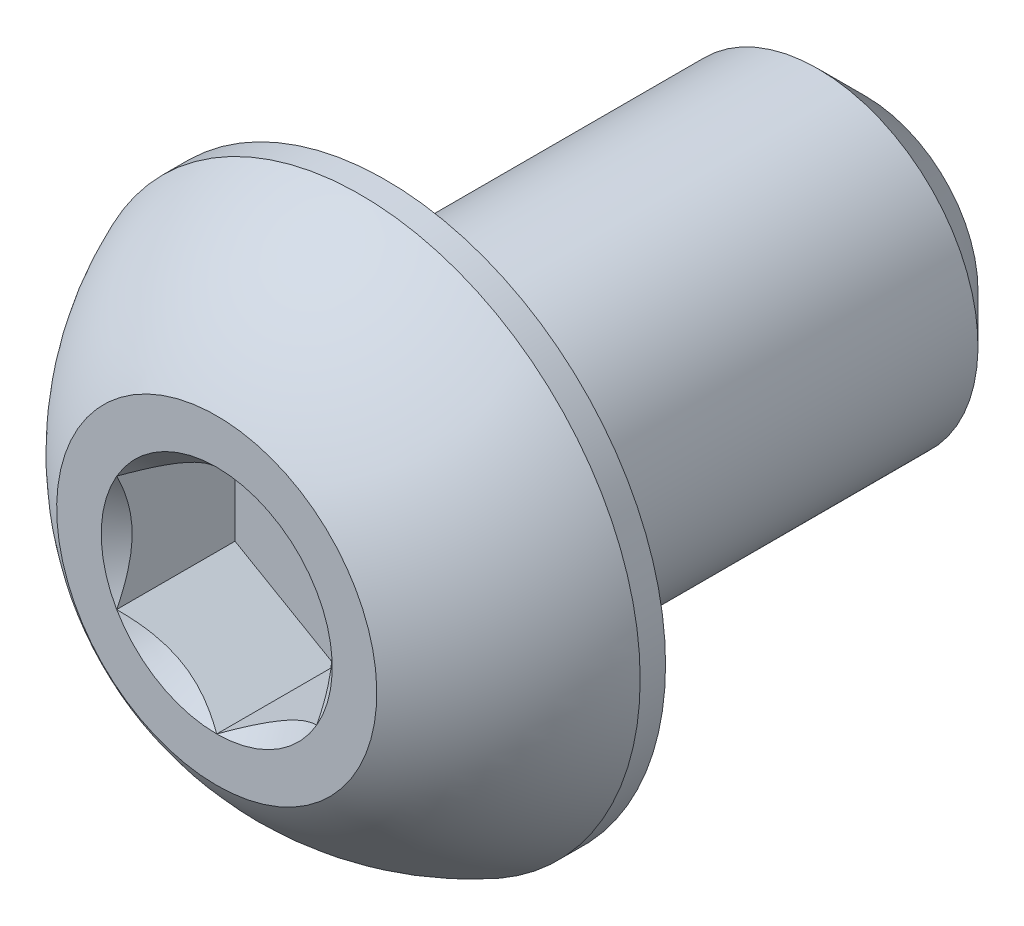
ISO-10303-21;
HEADER;
FILE_DESCRIPTION(('STEP AP214'),'2;1');
FILE_NAME('part.step','',(''),(''),'','','');
FILE_SCHEMA(('AUTOMOTIVE_DESIGN { 1 0 10303 214 1 1 1 1 }'));
ENDSEC;
DATA;
#1=APPLICATION_CONTEXT('core data for automotive mechanical design processes');
#2=APPLICATION_PROTOCOL_DEFINITION('international standard','automotive_design',2000,#1);
#3=PRODUCT_CONTEXT('',#1,'mechanical');
#4=PRODUCT('Part','Part','',(#3));
#5=PRODUCT_RELATED_PRODUCT_CATEGORY('part','',(#4));
#6=PRODUCT_DEFINITION_FORMATION('','',#4);
#7=PRODUCT_DEFINITION_CONTEXT('part definition',#1,'design');
#8=PRODUCT_DEFINITION('design','',#6,#7);
#9=PRODUCT_DEFINITION_SHAPE('','',#8);
#10=(LENGTH_UNIT() NAMED_UNIT(*) SI_UNIT(.MILLI.,.METRE.));
#11=(NAMED_UNIT(*) PLANE_ANGLE_UNIT() SI_UNIT($,.RADIAN.));
#12=(NAMED_UNIT(*) SI_UNIT($,.STERADIAN.) SOLID_ANGLE_UNIT());
#13=UNCERTAINTY_MEASURE_WITH_UNIT(LENGTH_MEASURE(1.E-05),#10,'distance_accuracy_value','');
#14=(GEOMETRIC_REPRESENTATION_CONTEXT(3) GLOBAL_UNCERTAINTY_ASSIGNED_CONTEXT((#13)) GLOBAL_UNIT_ASSIGNED_CONTEXT((#10,
#11,#12)) REPRESENTATION_CONTEXT('',''));
#15=CARTESIAN_POINT('',(0.,0.,0.));
#16=DIRECTION('',(0.,0.,1.));
#17=DIRECTION('',(1.,0.,0.));
#18=AXIS2_PLACEMENT_3D('',#15,#16,#17);
#19=CARTESIAN_POINT('',(0.,-3.17500000000001,-12.8778));
#20=DIRECTION('',(0.,0.,-1.));
#21=DIRECTION('',(0.,1.,0.));
#22=AXIS2_PLACEMENT_3D('',#19,#20,#21);
#23=PLANE('',#22);
#24=CARTESIAN_POINT('',(0.,0.,-12.8778));
#25=DIRECTION('',(0.,0.,-1.));
#26=DIRECTION('',(0.,1.,0.));
#27=AXIS2_PLACEMENT_3D('',#24,#25,#26);
#28=CIRCLE('',#27,2.2225);
#29=CARTESIAN_POINT('',(0.,2.2225,-12.8778));
#30=VERTEX_POINT('',#29);
#31=EDGE_CURVE('E177',#30,#30,#28,.T.);
#32=ORIENTED_EDGE('',*,*,#31,.T.);
#33=EDGE_LOOP('',(#32));
#34=FACE_BOUND('',#33,.T.);
#35=ADVANCED_FACE('F37',(#34),#23,.T.);
#36=CARTESIAN_POINT('',(0.,0.,-12.8778));
#37=DIRECTION('',(0.,0.,-1.));
#38=DIRECTION('',(0.,1.,0.));
#39=AXIS2_PLACEMENT_3D('',#36,#37,#38);
#40=CYLINDRICAL_SURFACE('',#39,3.17500000000001);
#41=CARTESIAN_POINT('',(0.,0.,-11.9253));
#42=DIRECTION('',(0.,0.,-1.));
#43=DIRECTION('',(0.,1.,0.));
#44=AXIS2_PLACEMENT_3D('',#41,#42,#43);
#45=CIRCLE('',#44,3.17500000000001);
#46=CARTESIAN_POINT('',(0.,3.175,-11.9253));
#47=VERTEX_POINT('',#46);
#48=EDGE_CURVE('E51',#47,#47,#45,.F.);
#49=ORIENTED_EDGE('',*,*,#48,.T.);
#50=EDGE_LOOP('',(#49));
#51=FACE_BOUND('',#50,.T.);
#52=CARTESIAN_POINT('',(0.,0.,-3.3528));
#53=DIRECTION('',(0.,0.,1.));
#54=DIRECTION('',(1.,0.,0.));
#55=AXIS2_PLACEMENT_3D('',#52,#53,#54);
#56=CIRCLE('',#55,3.17500000000001);
#57=CARTESIAN_POINT('',(3.17500000000001,0.,-3.3528));
#58=VERTEX_POINT('',#57);
#59=EDGE_CURVE('E174',#58,#58,#56,.F.);
#60=ORIENTED_EDGE('',*,*,#59,.T.);
#61=EDGE_LOOP('',(#60));
#62=FACE_BOUND('',#61,.T.);
#63=ADVANCED_FACE('F182',(#51,#62),#40,.T.);
#64=CARTESIAN_POINT('',(0.,0.,-12.8778));
#65=DIRECTION('',(0.,0.,1.));
#66=DIRECTION('',(0.,-1.,0.));
#67=AXIS2_PLACEMENT_3D('',#64,#65,#66);
#68=CONICAL_SURFACE('',#67,2.2225,0.785398163397447);
#69=ORIENTED_EDGE('',*,*,#48,.F.);
#70=EDGE_LOOP('',(#69));
#71=FACE_BOUND('',#70,.T.);
#72=ORIENTED_EDGE('',*,*,#31,.F.);
#73=EDGE_LOOP('',(#72));
#74=FACE_BOUND('',#73,.T.);
#75=ADVANCED_FACE('F39',(#71,#74),#68,.T.);
#76=CARTESIAN_POINT('',(0.,0.,-5.060315));
#77=DIRECTION('',(0.,0.,1.));
#78=DIRECTION('',(0.,-1.,0.));
#79=AXIS2_PLACEMENT_3D('',#76,#77,#78);
#80=SPHERICAL_SURFACE('',#79,5.97389428256184);
#81=CARTESIAN_POINT('',(0.,0.,0.));
#82=DIRECTION('',(0.,0.,1.));
#83=DIRECTION('',(1.,0.,0.));
#84=AXIS2_PLACEMENT_3D('',#81,#82,#83);
#85=CIRCLE('',#84,3.175);
#86=CARTESIAN_POINT('',(0.,-3.175,0.));
#87=VERTEX_POINT('',#86);
#88=EDGE_CURVE('E171',#87,#87,#85,.T.);
#89=CARTESIAN_POINT('',(0.,0.,-2.84988));
#90=DIRECTION('',(0.,0.,1.));
#91=DIRECTION('',(1.,0.,0.));
#92=AXIS2_PLACEMENT_3D('',#89,#90,#91);
#93=CIRCLE('',#92,5.5499);
#94=CARTESIAN_POINT('',(0.,-5.5499,-2.84988));
#95=VERTEX_POINT('',#94);
#96=EDGE_CURVE('E165',#95,#95,#93,.T.);
#97=CARTESIAN_POINT('',(0.,-3.175,0.));
#98=CARTESIAN_POINT('',(0.,-3.20828343957184,-0.0208830076580502));
#99=CARTESIAN_POINT('',(0.,-3.24136078860705,-0.0420944789280503));
#100=CARTESIAN_POINT('',(0.,-3.30709055775141,-0.0851658910984718));
#101=CARTESIAN_POINT('',(0.,-3.33974297786056,-0.107025831998893));
#102=CARTESIAN_POINT('',(0.,-3.40461014130008,-0.151385725836676));
#103=CARTESIAN_POINT('',(0.,-3.43682488463043,-0.173885678774039));
#104=CARTESIAN_POINT('',(0.,-3.50080416139461,-0.219516822259479));
#105=CARTESIAN_POINT('',(0.,-3.53256869482844,-0.242648012807557));
#106=CARTESIAN_POINT('',(0.,-3.59563518208834,-0.289532629449102));
#107=CARTESIAN_POINT('',(0.,-3.62693713591442,-0.313286055542569));
#108=CARTESIAN_POINT('',(0.,-3.68906627753106,-0.36140589409133));
#109=CARTESIAN_POINT('',(0.,-3.71989346532163,-0.385772306546626));
#110=CARTESIAN_POINT('',(0.,-3.78106107243204,-0.435108631276877));
#111=CARTESIAN_POINT('',(0.,-3.8114014917519,-0.460078543551833));
#112=CARTESIAN_POINT('',(0.,-3.87158374923259,-0.510612146063938));
#113=CARTESIAN_POINT('',(0.,-3.90142558739343,-0.536175836301086));
#114=CARTESIAN_POINT('',(0.,-3.96059906392414,-0.587887041792083));
#115=CARTESIAN_POINT('',(0.,-3.989930702294,-0.614034557045931));
#116=CARTESIAN_POINT('',(0.,-4.04807235926832,-0.666903232293407));
#117=CARTESIAN_POINT('',(0.,-4.07688237787279,-0.693624392287034));
#118=CARTESIAN_POINT('',(0.,-4.13396957842491,-0.747629953401057));
#119=CARTESIAN_POINT('',(0.,-4.16224676037257,-0.774914354521453));
#120=CARTESIAN_POINT('',(0.,-4.21825727817542,-0.830035774981947));
#121=CARTESIAN_POINT('',(0.,-4.24599061403061,-0.857872794322045));
#122=CARTESIAN_POINT('',(0.,-4.30090264195357,-0.91408861315902));
#123=CARTESIAN_POINT('',(0.,-4.32808133402134,-0.942467412655899));
#124=CARTESIAN_POINT('',(0.,-4.38187349261953,-0.999755742806741));
#125=CARTESIAN_POINT('',(0.,-4.40848695914995,-1.0286652734607));
#126=CARTESIAN_POINT('',(0.,-4.46113830498838,-1.08700381029123));
#127=CARTESIAN_POINT('',(0.,-4.48717618429639,-1.11643281646778));
#128=CARTESIAN_POINT('',(0.,-4.53866621810402,-1.17579884645643));
#129=CARTESIAN_POINT('',(0.,-4.56411837260364,-1.20573587026853));
#130=CARTESIAN_POINT('',(0.,-4.61442704725457,-1.26610627984964));
#131=CARTESIAN_POINT('',(0.,-4.63928356740587,-1.29653966561866));
#132=CARTESIAN_POINT('',(0.,-4.68839129572448,-1.3578909501815));
#133=CARTESIAN_POINT('',(0.,-4.71264250389178,-1.38880884897531));
#134=CARTESIAN_POINT('',(0.,-4.76053016627881,-1.45111712201534));
#135=CARTESIAN_POINT('',(0.,-4.78416662049853,-1.48250749626155));
#136=CARTESIAN_POINT('',(0.,-4.8308155723751,-1.54574849868041));
#137=CARTESIAN_POINT('',(0.,-4.85382807003194,-1.57759912685306));
#138=CARTESIAN_POINT('',(0.,-4.89922014909859,-1.64174823640362));
#139=CARTESIAN_POINT('',(0.,-4.92159973050841,-1.67404671778154));
#140=CARTESIAN_POINT('',(0.,-4.96571726381658,-1.73907895865427));
#141=CARTESIAN_POINT('',(0.,-4.98745521571493,-1.77181271814908));
#142=CARTESIAN_POINT('',(0.,-5.03028102654719,-1.83770277069632));
#143=CARTESIAN_POINT('',(0.,-5.0513688854811,-1.87085906374874));
#144=CARTESIAN_POINT('',(0.,-5.09288630004063,-1.93758127434189));
#145=CARTESIAN_POINT('',(0.,-5.11331585566624,-1.97114719188261));
#146=CARTESIAN_POINT('',(0.,-5.15350870956168,-2.03867558290299));
#147=CARTESIAN_POINT('',(0.,-5.17327200783151,-2.07263805638265));
#148=CARTESIAN_POINT('',(0.,-5.21212465239608,-2.14094633632486));
#149=CARTESIAN_POINT('',(0.,-5.23121399869082,-2.17529214278741));
#150=CARTESIAN_POINT('',(0.,-5.26871130697935,-2.2443537165359));
#151=CARTESIAN_POINT('',(0.,-5.28711926897315,-2.27906948382184));
#152=CARTESIAN_POINT('',(0.,-5.32324664200827,-2.3488574628552));
#153=CARTESIAN_POINT('',(0.,-5.3409660530496,-2.38392967460262));
#154=CARTESIAN_POINT('',(0.,-5.37570942417474,-2.45441688802313));
#155=CARTESIAN_POINT('',(0.,-5.39273338425856,-2.48983188969622));
#156=CARTESIAN_POINT('',(0.,-5.42607922958184,-2.56099089271574));
#157=CARTESIAN_POINT('',(0.,-5.44240111482132,-2.59673489406217));
#158=CARTESIAN_POINT('',(0.,-5.47433643994316,-2.66853798649801));
#159=CARTESIAN_POINT('',(0.,-5.48994987982553,-2.70459707758742));
#160=CARTESIAN_POINT('',(0.,-5.52046229408188,-2.77701628549785));
#161=CARTESIAN_POINT('',(0.,-5.53536126845586,-2.81337640231887));
#162=CARTESIAN_POINT('',(0.,-5.5499,-2.84988));
#163=B_SPLINE_CURVE_WITH_KNOTS('',3,(#97,#98,#99,#100,#101,#102,#103,#104,#105,#106,#107,#108,
#109,#110,#111,#112,#113,#114,#115,#116,#117,#118,#119,#120,#121,#122,#123,#124,#125,#126,#127,
#128,#129,#130,#131,#132,#133,#134,#135,#136,#137,#138,#139,#140,#141,#142,#143,#144,#145,#146,
#147,#148,#149,#150,#151,#152,#153,#154,#155,#156,#157,#158,#159,#160,#161,#162),.UNSPECIFIED.,
.F.,.F.,(4,2,2,2,2,2,2,2,2,2,2,2,2,2,2,2,2,2,2,2,2,2,2,2,2,2,2,2,2,2,2,2,4),(0.,0.1178750807537,
0.235750161507399,0.353625242261099,0.471500323014798,0.589375403768498,0.707250484522198,
0.825125565275897,0.943000646029597,1.0608757267833,1.17875080753699,1.2966258882907,
1.41450096904439,1.53237604979809,1.65025113055179,1.76812621130549,1.88600129205919,
2.00387637281289,2.12175145356659,2.23962653432029,2.35750161507399,2.47537669582769,
2.59325177658139,2.71112685733509,2.82900193808879,2.94687701884249,3.06475209959619,
3.18262718034989,3.30050226110359,3.41837734185729,3.53625242261099,3.65412750336469,
3.77200258411839),.UNSPECIFIED.);
#164=EDGE_CURVE('BSEAM187',#87,#95,#163,.T.);
#165=ORIENTED_EDGE('',*,*,#88,.F.);
#166=ORIENTED_EDGE('',*,*,#96,.T.);
#167=ORIENTED_EDGE('',*,*,#164,.T.);
#168=ORIENTED_EDGE('',*,*,#164,.F.);
#169=EDGE_LOOP('',(#165,#167,#166,#168));
#170=FACE_BOUND('',#169,.T.);
#171=ADVANCED_FACE('F187',(#170),#80,.T.);
#172=CARTESIAN_POINT('',(0.,-3.175,0.));
#173=DIRECTION('',(0.,0.,-1.));
#174=DIRECTION('',(-1.,0.,0.));
#175=AXIS2_PLACEMENT_3D('',#172,#173,#174);
#176=PLANE('',#175);
#177=CARTESIAN_POINT('',(0.,0.,0.));
#178=DIRECTION('',(0.,0.,1.));
#179=DIRECTION('',(1.,0.,0.));
#180=AXIS2_PLACEMENT_3D('',#177,#178,#179);
#181=CIRCLE('',#180,2.29135888084633);
#182=CARTESIAN_POINT('',(-1.984375,1.14567944042316,0.));
#183=VERTEX_POINT('',#182);
#184=CARTESIAN_POINT('',(-1.984375,-1.14567944042316,0.));
#185=VERTEX_POINT('',#184);
#186=EDGE_CURVE('E64',#183,#185,#181,.T.);
#187=ORIENTED_EDGE('',*,*,#186,.F.);
#188=CARTESIAN_POINT('',(0.,2.29135888084633,0.));
#189=VERTEX_POINT('',#188);
#190=EDGE_CURVE('E136',#189,#183,#181,.T.);
#191=ORIENTED_EDGE('',*,*,#190,.F.);
#192=CARTESIAN_POINT('',(1.984375,1.14567944042316,0.));
#193=VERTEX_POINT('',#192);
#194=EDGE_CURVE('E133',#193,#189,#181,.T.);
#195=ORIENTED_EDGE('',*,*,#194,.F.);
#196=CARTESIAN_POINT('',(1.984375,-1.14567944042316,0.));
#197=VERTEX_POINT('',#196);
#198=EDGE_CURVE('E104',#197,#193,#181,.T.);
#199=ORIENTED_EDGE('',*,*,#198,.F.);
#200=CARTESIAN_POINT('',(0.,-2.29135888084633,0.));
#201=VERTEX_POINT('',#200);
#202=EDGE_CURVE('E96',#201,#197,#181,.T.);
#203=ORIENTED_EDGE('',*,*,#202,.F.);
#204=EDGE_CURVE('E57',#185,#201,#181,.T.);
#205=ORIENTED_EDGE('',*,*,#204,.F.);
#206=EDGE_LOOP('',(#187,#191,#195,#199,#203,#205));
#207=FACE_BOUND('',#206,.T.);
#208=ORIENTED_EDGE('',*,*,#88,.T.);
#209=EDGE_LOOP('',(#208));
#210=FACE_BOUND('',#209,.T.);
#211=ADVANCED_FACE('F130',(#207,#210),#176,.F.);
#212=CARTESIAN_POINT('',(0.,-5.5499,-3.3528));
#213=DIRECTION('',(0.,0.,1.));
#214=DIRECTION('',(1.,0.,0.));
#215=AXIS2_PLACEMENT_3D('',#212,#213,#214);
#216=PLANE('',#215);
#217=ORIENTED_EDGE('',*,*,#59,.F.);
#218=EDGE_LOOP('',(#217));
#219=FACE_BOUND('',#218,.T.);
#220=CARTESIAN_POINT('',(0.,0.,-3.3528));
#221=DIRECTION('',(0.,0.,1.));
#222=DIRECTION('',(1.,0.,0.));
#223=AXIS2_PLACEMENT_3D('',#220,#221,#222);
#224=CIRCLE('',#223,5.5499);
#225=CARTESIAN_POINT('',(5.5499,0.,-3.3528));
#226=VERTEX_POINT('',#225);
#227=EDGE_CURVE('E168',#226,#226,#224,.T.);
#228=ORIENTED_EDGE('',*,*,#227,.F.);
#229=EDGE_LOOP('',(#228));
#230=FACE_BOUND('',#229,.T.);
#231=ADVANCED_FACE('F201',(#219,#230),#216,.F.);
#232=CARTESIAN_POINT('',(0.,0.,0.));
#233=DIRECTION('',(0.,0.,1.));
#234=DIRECTION('',(1.,0.,0.));
#235=AXIS2_PLACEMENT_3D('',#232,#233,#234);
#236=CYLINDRICAL_SURFACE('',#235,5.5499);
#237=ORIENTED_EDGE('',*,*,#96,.F.);
#238=EDGE_LOOP('',(#237));
#239=FACE_BOUND('',#238,.T.);
#240=ORIENTED_EDGE('',*,*,#227,.T.);
#241=EDGE_LOOP('',(#240));
#242=FACE_BOUND('',#241,.T.);
#243=ADVANCED_FACE('F204',(#239,#242),#236,.T.);
#244=CARTESIAN_POINT('',(0.,0.,0.));
#245=DIRECTION('',(0.,0.,1.));
#246=DIRECTION('',(1.,0.,0.));
#247=AXIS2_PLACEMENT_3D('',#244,#245,#246);
#248=CONICAL_SURFACE('',#247,2.29135888084633,0.78539816339745);
#249=ORIENTED_EDGE('',*,*,#198,.T.);
#250=CARTESIAN_POINT('',(1.984375,-2.28495242157822,0.734984078816567));
#251=CARTESIAN_POINT('',(1.984375,-2.22931635455402,0.692986685550761));
#252=CARTESIAN_POINT('',(1.984375,-2.17336876548389,0.651396054076335));
#253=CARTESIAN_POINT('',(1.984375,-2.06072770258171,0.569208461471479));
#254=CARTESIAN_POINT('',(1.984375,-2.00403404503435,0.528611752405042));
#255=CARTESIAN_POINT('',(1.984375,-1.88936329173488,0.448303503174668));
#256=CARTESIAN_POINT('',(1.984375,-1.83137965519348,0.408601258813307));
#257=CARTESIAN_POINT('',(1.984375,-1.7144280213784,0.330685173401291));
#258=CARTESIAN_POINT('',(1.984375,-1.65546009407227,0.292471227194368));
#259=CARTESIAN_POINT('',(1.984375,-1.47005472306035,0.176252834013636));
#260=CARTESIAN_POINT('',(1.984375,-1.34163909427883,0.101347886872381));
#261=CARTESIAN_POINT('',(1.984375,-1.0784038470548,-0.0356697845602625));
#262=CARTESIAN_POINT('',(1.984375,-0.943607781407424,-0.0978256335176254));
#263=CARTESIAN_POINT('',(1.984375,-0.741275100444881,-0.173867421311382));
#264=CARTESIAN_POINT('',(1.984375,-0.676735408881095,-0.195691938673995));
#265=CARTESIAN_POINT('',(1.984375,-0.546098118112761,-0.234159536462205));
#266=CARTESIAN_POINT('',(1.984375,-0.480000411919955,-0.250802259934452));
#267=CARTESIAN_POINT('',(1.984375,-0.347746170028531,-0.277764619130277));
#268=CARTESIAN_POINT('',(1.984375,-0.281612071479122,-0.288192590264109));
#269=CARTESIAN_POINT('',(1.984375,-0.148636620052349,-0.302521852623404));
#270=CARTESIAN_POINT('',(1.984375,-0.0817953907393231,-0.306424265772614));
#271=CARTESIAN_POINT('',(1.984375,0.0495156750890649,-0.307412948667327));
#272=CARTESIAN_POINT('',(1.984375,0.113983775102992,-0.304740821124985));
#273=CARTESIAN_POINT('',(1.984375,0.242367515846177,-0.293260789502485));
#274=CARTESIAN_POINT('',(1.984375,0.30628310229592,-0.284452289360786));
#275=CARTESIAN_POINT('',(1.984375,0.434181040262184,-0.261030978667103));
#276=CARTESIAN_POINT('',(1.984375,0.49814502685831,-0.246319393767914));
#277=CARTESIAN_POINT('',(1.984375,0.624675616953008,-0.211873818587874));
#278=CARTESIAN_POINT('',(1.984375,0.687242336899689,-0.192140248550805));
#279=CARTESIAN_POINT('',(1.984375,0.884225483826088,-0.12258776276924));
#280=CARTESIAN_POINT('',(1.984375,1.01583674256468,-0.064847588743503));
#281=CARTESIAN_POINT('',(1.984375,1.27288659242652,0.0635303365887985));
#282=CARTESIAN_POINT('',(1.984375,1.3983008827048,0.134214424919413));
#283=CARTESIAN_POINT('',(1.984375,1.57956687990221,0.244516663813199));
#284=CARTESIAN_POINT('',(1.984375,1.63738271299424,0.280969829475364));
#285=CARTESIAN_POINT('',(1.984375,1.75202215386202,0.355415963291705));
#286=CARTESIAN_POINT('',(1.984375,1.80884568601362,0.393409048078055));
#287=CARTESIAN_POINT('',(1.984375,1.92116923084255,0.470338808893091));
#288=CARTESIAN_POINT('',(1.984375,1.97667624512253,0.509265313038791));
#289=CARTESIAN_POINT('',(1.984375,2.08693170717166,0.588147746121387));
#290=CARTESIAN_POINT('',(1.984375,2.14168035934793,0.62810338902403));
#291=CARTESIAN_POINT('',(1.984375,2.19611149046622,0.668480611285427));
#292=B_SPLINE_CURVE_WITH_KNOTS('',3,(#250,#251,#252,#253,#254,#255,#256,#257,#258,#259,#260,
#261,#262,#263,#264,#265,#266,#267,#268,#269,#270,#271,#272,#273,#274,#275,#276,#277,#278,#279,
#280,#281,#282,#283,#284,#285,#286,#287,#288,#289,#290,#291),.UNSPECIFIED.,.F.,.F.,(4,2,2,2,2,2,
2,2,2,2,2,2,2,2,2,2,2,2,2,2,4),(0.,0.209126070008322,0.418304637356569,0.629103979977992,
0.839888401371184,1.28549951116127,1.72957750768351,1.93379389749971,2.13802435186698,
2.33858179514333,2.53910475350639,2.73236963400794,2.92565329006887,3.12231577097487,
3.31896180041345,3.74886295245172,4.18033428125362,4.3853601718029,4.59040161996383,
4.79377749165108,4.99709743524131),.UNSPECIFIED.);
#293=EDGE_CURVE('E11',#197,#193,#292,.T.);
#294=ORIENTED_EDGE('',*,*,#293,.F.);
#295=EDGE_LOOP('',(#249,#294));
#296=FACE_BOUND('',#295,.T.);
#297=ADVANCED_FACE('F108',(#296),#248,.F.);
#298=ORIENTED_EDGE('',*,*,#194,.T.);
#299=CARTESIAN_POINT('',(1.984575,1.14556397036933,0.000115478781843379));
#300=CARTESIAN_POINT('',(1.9163590048332,1.18494849354192,-0.0392371477360852));
#301=CARTESIAN_POINT('',(1.84700231489303,1.22499159714897,-0.0762786895538154));
#302=CARTESIAN_POINT('',(1.70557619954781,1.30664400291398,-0.144101141576677));
#303=CARTESIAN_POINT('',(1.63349332126322,1.34826107209555,-0.174844310908246));
#304=CARTESIAN_POINT('',(1.488141602734,1.43217992591557,-0.227508111188786));
#305=CARTESIAN_POINT('',(1.41490978751306,1.47446033414663,-0.249561124120036));
#306=CARTESIAN_POINT('',(1.26683381740529,1.55995203534886,-0.283538507056124));
#307=CARTESIAN_POINT('',(1.19199418724658,1.60316071596705,-0.295488243908272));
#308=CARTESIAN_POINT('',(1.06301458545618,1.6776271237807,-0.306269900918094));
#309=CARTESIAN_POINT('',(1.00904128422756,1.7087886237741,-0.30786610094093));
#310=CARTESIAN_POINT('',(0.901182881480199,1.77106070163465,-0.305178161134708));
#311=CARTESIAN_POINT('',(0.847297817514476,1.80217125782056,-0.300891959659541));
#312=CARTESIAN_POINT('',(0.740036461751395,1.86409863044402,-0.286683126986481));
#313=CARTESIAN_POINT('',(0.686660807239859,1.89491507894443,-0.276754189547727));
#314=CARTESIAN_POINT('',(0.580832482591103,1.95601509066828,-0.251804915725461));
#315=CARTESIAN_POINT('',(0.528379742028898,1.9862986945516,-0.236784969610512));
#316=CARTESIAN_POINT('',(0.394017661036351,2.06387267818152,-0.19219214836433));
#317=CARTESIAN_POINT('',(0.312941642841675,2.11068193911104,-0.159257004061667));
#318=CARTESIAN_POINT('',(0.19372669327016,2.17951072233758,-0.103657558797803));
#319=CARTESIAN_POINT('',(0.154440075613999,2.20219286161692,-0.0841224079481377));
#320=CARTESIAN_POINT('',(0.0765946381319469,2.24713694590237,-0.0432712618805986));
#321=CARTESIAN_POINT('',(0.0380353888983011,2.26939913882716,-0.0219563604316497));
#322=CARTESIAN_POINT('',(-0.000200000000000015,2.29147435090017,0.000115478781842912));
#323=B_SPLINE_CURVE_WITH_KNOTS('',3,(#299,#300,#301,#302,#303,#304,#305,#306,#307,#308,#309,
#310,#311,#312,#313,#314,#315,#316,#317,#318,#319,#320,#321,#322),.UNSPECIFIED.,.F.,.F.,(4,2,2,
2,2,2,2,2,2,2,2,4),(0.,0.264339630306627,0.530219665093694,0.791876416371461,1.05287424418109,
1.239639843932,1.42647091743852,1.61351120244035,1.8005371524754,2.09764209964316,
2.24579179873714,2.39385111134157),.UNSPECIFIED.);
#324=EDGE_CURVE('E135',#193,#189,#323,.T.);
#325=ORIENTED_EDGE('',*,*,#324,.F.);
#326=EDGE_LOOP('',(#298,#325));
#327=FACE_BOUND('',#326,.T.);
#328=ADVANCED_FACE('F289',(#327),#248,.F.);
#329=ORIENTED_EDGE('',*,*,#190,.T.);
#330=CARTESIAN_POINT('',(0.000199999999999816,2.29147435090017,0.000115478781843248));
#331=CARTESIAN_POINT('',(-0.0680159951668025,2.25208982772757,-0.0392371477360852));
#332=CARTESIAN_POINT('',(-0.137372685106966,2.21204672412052,-0.0762786895538152));
#333=CARTESIAN_POINT('',(-0.278798800452187,2.13039431835551,-0.144101141576677));
#334=CARTESIAN_POINT('',(-0.350881678736783,2.08877724917394,-0.174844310908246));
#335=CARTESIAN_POINT('',(-0.496233397266004,2.00485839535392,-0.227508111188787));
#336=CARTESIAN_POINT('',(-0.569465212486938,1.96257798712287,-0.249561124120036));
#337=CARTESIAN_POINT('',(-0.717541182594706,1.87708628592063,-0.283538507056124));
#338=CARTESIAN_POINT('',(-0.792380812753425,1.83387760530244,-0.295488243908271));
#339=CARTESIAN_POINT('',(-0.921360414543816,1.75941119748879,-0.306269900918094));
#340=CARTESIAN_POINT('',(-0.975333715772442,1.72824969749539,-0.30786610094093));
#341=CARTESIAN_POINT('',(-1.0831921185198,1.66597761963484,-0.305178161134708));
#342=CARTESIAN_POINT('',(-1.13707718248552,1.63486706344893,-0.300891959659541));
#343=CARTESIAN_POINT('',(-1.2443385382486,1.57293969082547,-0.286683126986481));
#344=CARTESIAN_POINT('',(-1.29771419276014,1.54212324232506,-0.276754189547727));
#345=CARTESIAN_POINT('',(-1.4035425174089,1.48102323060122,-0.251804915725462));
#346=CARTESIAN_POINT('',(-1.4559952579711,1.45073962671789,-0.236784969610512));
#347=CARTESIAN_POINT('',(-1.59035733896365,1.37316564308797,-0.192192148364331));
#348=CARTESIAN_POINT('',(-1.67143335715832,1.32635638215845,-0.159257004061668));
#349=CARTESIAN_POINT('',(-1.79064830672984,1.25752759893191,-0.103657558797804));
#350=CARTESIAN_POINT('',(-1.829934924386,1.23484545965257,-0.0841224079481379));
#351=CARTESIAN_POINT('',(-1.90778036186805,1.18990137536713,-0.0432712618805987));
#352=CARTESIAN_POINT('',(-1.9463396111017,1.16763918244233,-0.0219563604316498));
#353=CARTESIAN_POINT('',(-1.984575,1.14556397036933,0.000115478781843054));
#354=B_SPLINE_CURVE_WITH_KNOTS('',3,(#330,#331,#332,#333,#334,#335,#336,#337,#338,#339,#340,
#341,#342,#343,#344,#345,#346,#347,#348,#349,#350,#351,#352,#353),.UNSPECIFIED.,.F.,.F.,(4,2,2,
2,2,2,2,2,2,2,2,4),(0.,0.264339630306626,0.530219665093694,0.79187641637146,1.05287424418109,
1.239639843932,1.42647091743852,1.61351120244035,1.8005371524754,2.09764209964316,
2.24579179873714,2.39385111134157),.UNSPECIFIED.);
#355=EDGE_CURVE('E140',#189,#183,#354,.T.);
#356=ORIENTED_EDGE('',*,*,#355,.F.);
#357=EDGE_LOOP('',(#329,#356));
#358=FACE_BOUND('',#357,.T.);
#359=ADVANCED_FACE('F143',(#358),#248,.F.);
#360=ORIENTED_EDGE('',*,*,#186,.T.);
#361=CARTESIAN_POINT('',(-1.984375,-2.28495242157822,0.734984078816568));
#362=CARTESIAN_POINT('',(-1.984375,-2.22931635455402,0.692986685550762));
#363=CARTESIAN_POINT('',(-1.984375,-2.17336876548389,0.651396054076336));
#364=CARTESIAN_POINT('',(-1.984375,-2.06072770258171,0.569208461471479));
#365=CARTESIAN_POINT('',(-1.984375,-2.00403404503435,0.528611752405043));
#366=CARTESIAN_POINT('',(-1.984375,-1.88936329173489,0.448303503174669));
#367=CARTESIAN_POINT('',(-1.984375,-1.83137965519348,0.408601258813307));
#368=CARTESIAN_POINT('',(-1.984375,-1.7144280213784,0.330685173401291));
#369=CARTESIAN_POINT('',(-1.984375,-1.65546009407228,0.292471227194368));
#370=CARTESIAN_POINT('',(-1.984375,-1.47005472306035,0.176252834013636));
#371=CARTESIAN_POINT('',(-1.984375,-1.34163909427883,0.101347886872381));
#372=CARTESIAN_POINT('',(-1.984375,-1.0784038470548,-0.0356697845602627));
#373=CARTESIAN_POINT('',(-1.984375,-0.943607781407424,-0.0978256335176258));
#374=CARTESIAN_POINT('',(-1.984375,-0.741275100444882,-0.173867421311381));
#375=CARTESIAN_POINT('',(-1.984375,-0.676735408881095,-0.195691938673995));
#376=CARTESIAN_POINT('',(-1.984375,-0.546098118112762,-0.234159536462205));
#377=CARTESIAN_POINT('',(-1.984375,-0.480000411919956,-0.250802259934452));
#378=CARTESIAN_POINT('',(-1.984375,-0.347746170028532,-0.277764619130277));
#379=CARTESIAN_POINT('',(-1.984375,-0.281612071479123,-0.288192590264108));
#380=CARTESIAN_POINT('',(-1.984375,-0.14863662005235,-0.302521852623404));
#381=CARTESIAN_POINT('',(-1.984375,-0.0817953907393237,-0.306424265772614));
#382=CARTESIAN_POINT('',(-1.984375,0.0495156750890643,-0.307412948667328));
#383=CARTESIAN_POINT('',(-1.984375,0.113983775102991,-0.304740821124985));
#384=CARTESIAN_POINT('',(-1.984375,0.242367515846177,-0.293260789502485));
#385=CARTESIAN_POINT('',(-1.984375,0.306283102295919,-0.284452289360786));
#386=CARTESIAN_POINT('',(-1.984375,0.434181040262184,-0.261030978667103));
#387=CARTESIAN_POINT('',(-1.984375,0.498145026858309,-0.246319393767914));
#388=CARTESIAN_POINT('',(-1.984375,0.624675616953007,-0.211873818587874));
#389=CARTESIAN_POINT('',(-1.984375,0.687242336899689,-0.192140248550805));
#390=CARTESIAN_POINT('',(-1.984375,0.884225483826087,-0.12258776276924));
#391=CARTESIAN_POINT('',(-1.984375,1.01583674256468,-0.0648475887435035));
#392=CARTESIAN_POINT('',(-1.984375,1.27288659242652,0.0635303365887976));
#393=CARTESIAN_POINT('',(-1.984375,1.3983008827048,0.134214424919412));
#394=CARTESIAN_POINT('',(-1.984375,1.57956687990221,0.244516663813199));
#395=CARTESIAN_POINT('',(-1.984375,1.63738271299424,0.280969829475363));
#396=CARTESIAN_POINT('',(-1.984375,1.75202215386202,0.355415963291705));
#397=CARTESIAN_POINT('',(-1.984375,1.80884568601362,0.393409048078054));
#398=CARTESIAN_POINT('',(-1.984375,1.92116923084255,0.47033880889309));
#399=CARTESIAN_POINT('',(-1.984375,1.97667624512253,0.509265313038791));
#400=CARTESIAN_POINT('',(-1.984375,2.08693170717166,0.588147746121386));
#401=CARTESIAN_POINT('',(-1.984375,2.14168035934793,0.62810338902403));
#402=CARTESIAN_POINT('',(-1.984375,2.19611149046622,0.668480611285426));
#403=B_SPLINE_CURVE_WITH_KNOTS('',3,(#361,#362,#363,#364,#365,#366,#367,#368,#369,#370,#371,
#372,#373,#374,#375,#376,#377,#378,#379,#380,#381,#382,#383,#384,#385,#386,#387,#388,#389,#390,
#391,#392,#393,#394,#395,#396,#397,#398,#399,#400,#401,#402),.UNSPECIFIED.,.F.,.F.,(4,2,2,2,2,2,
2,2,2,2,2,2,2,2,2,2,2,2,2,2,4),(0.,0.209126070008322,0.418304637356569,0.629103979977993,
0.839888401371185,1.28549951116127,1.72957750768351,1.93379389749971,2.13802435186698,
2.33858179514334,2.53910475350639,2.73236963400794,2.92565329006887,3.12231577097487,
3.31896180041345,3.74886295245172,4.18033428125362,4.3853601718029,4.59040161996383,
4.79377749165108,4.99709743524131),.UNSPECIFIED.);
#404=EDGE_CURVE('E147',#183,#185,#403,.F.);
#405=ORIENTED_EDGE('',*,*,#404,.F.);
#406=EDGE_LOOP('',(#360,#405));
#407=FACE_BOUND('',#406,.T.);
#408=ADVANCED_FACE('F283',(#407),#248,.F.);
#409=ORIENTED_EDGE('',*,*,#204,.T.);
#410=CARTESIAN_POINT('',(-1.984575,-1.14556397036933,0.000115478781842946));
#411=CARTESIAN_POINT('',(-1.9163590048332,-1.18494849354192,-0.0392371477360853));
#412=CARTESIAN_POINT('',(-1.84700231489303,-1.22499159714897,-0.0762786895538154));
#413=CARTESIAN_POINT('',(-1.70557619954781,-1.30664400291398,-0.144101141576677));
#414=CARTESIAN_POINT('',(-1.63349332126322,-1.34826107209555,-0.174844310908247));
#415=CARTESIAN_POINT('',(-1.488141602734,-1.43217992591557,-0.227508111188787));
#416=CARTESIAN_POINT('',(-1.41490978751306,-1.47446033414662,-0.249561124120036));
#417=CARTESIAN_POINT('',(-1.26683381740529,-1.55995203534886,-0.283538507056124));
#418=CARTESIAN_POINT('',(-1.19199418724658,-1.60316071596705,-0.295488243908272));
#419=CARTESIAN_POINT('',(-1.06301458545618,-1.6776271237807,-0.306269900918094));
#420=CARTESIAN_POINT('',(-1.00904128422756,-1.7087886237741,-0.30786610094093));
#421=CARTESIAN_POINT('',(-0.9011828814802,-1.77106070163465,-0.305178161134708));
#422=CARTESIAN_POINT('',(-0.847297817514477,-1.80217125782056,-0.300891959659541));
#423=CARTESIAN_POINT('',(-0.740036461751396,-1.86409863044402,-0.286683126986481));
#424=CARTESIAN_POINT('',(-0.68666080723986,-1.89491507894443,-0.276754189547728));
#425=CARTESIAN_POINT('',(-0.580832482591104,-1.95601509066827,-0.251804915725462));
#426=CARTESIAN_POINT('',(-0.528379742028899,-1.9862986945516,-0.236784969610512));
#427=CARTESIAN_POINT('',(-0.394017661036351,-2.06387267818152,-0.19219214836433));
#428=CARTESIAN_POINT('',(-0.312941642841676,-2.11068193911104,-0.159257004061667));
#429=CARTESIAN_POINT('',(-0.19372669327016,-2.17951072233758,-0.103657558797803));
#430=CARTESIAN_POINT('',(-0.154440075613998,-2.20219286161692,-0.0841224079481376));
#431=CARTESIAN_POINT('',(-0.0765946381319466,-2.24713694590237,-0.0432712618805985));
#432=CARTESIAN_POINT('',(-0.0380353888983007,-2.26939913882716,-0.0219563604316496));
#433=CARTESIAN_POINT('',(0.000200000000000678,-2.29147435090017,0.000115478781842942));
#434=B_SPLINE_CURVE_WITH_KNOTS('',3,(#410,#411,#412,#413,#414,#415,#416,#417,#418,#419,#420,
#421,#422,#423,#424,#425,#426,#427,#428,#429,#430,#431,#432,#433),.UNSPECIFIED.,.F.,.F.,(4,2,2,
2,2,2,2,2,2,2,2,4),(0.,0.264339630306627,0.530219665093694,0.79187641637146,1.05287424418109,
1.239639843932,1.42647091743852,1.61351120244035,1.8005371524754,2.09764209964316,
2.24579179873714,2.39385111134157),.UNSPECIFIED.);
#435=EDGE_CURVE('E120',#185,#201,#434,.T.);
#436=ORIENTED_EDGE('',*,*,#435,.F.);
#437=EDGE_LOOP('',(#409,#436));
#438=FACE_BOUND('',#437,.T.);
#439=ADVANCED_FACE('F231',(#438),#248,.F.);
#440=ORIENTED_EDGE('',*,*,#202,.T.);
#441=CARTESIAN_POINT('',(-0.000199999999999596,-2.29147435090017,0.000115478781843248));
#442=CARTESIAN_POINT('',(0.0680159951668027,-2.25208982772757,-0.0392371477360854));
#443=CARTESIAN_POINT('',(0.137372685106966,-2.21204672412052,-0.0762786895538155));
#444=CARTESIAN_POINT('',(0.278798800452188,-2.13039431835551,-0.144101141576677));
#445=CARTESIAN_POINT('',(0.350881678736783,-2.08877724917394,-0.174844310908246));
#446=CARTESIAN_POINT('',(0.496233397266004,-2.00485839535392,-0.227508111188786));
#447=CARTESIAN_POINT('',(0.569465212486939,-1.96257798712287,-0.249561124120036));
#448=CARTESIAN_POINT('',(0.717541182594707,-1.87708628592063,-0.283538507056124));
#449=CARTESIAN_POINT('',(0.792380812753425,-1.83387760530244,-0.295488243908272));
#450=CARTESIAN_POINT('',(0.921360414543816,-1.75941119748879,-0.306269900918094));
#451=CARTESIAN_POINT('',(0.975333715772443,-1.72824969749539,-0.307866100940931));
#452=CARTESIAN_POINT('',(1.0831921185198,-1.66597761963484,-0.305178161134708));
#453=CARTESIAN_POINT('',(1.13707718248552,-1.63486706344893,-0.300891959659541));
#454=CARTESIAN_POINT('',(1.2443385382486,-1.57293969082547,-0.286683126986481));
#455=CARTESIAN_POINT('',(1.29771419276014,-1.54212324232506,-0.276754189547727));
#456=CARTESIAN_POINT('',(1.4035425174089,-1.48102323060122,-0.251804915725462));
#457=CARTESIAN_POINT('',(1.4559952579711,-1.45073962671789,-0.236784969610512));
#458=CARTESIAN_POINT('',(1.59035733896365,-1.37316564308797,-0.19219214836433));
#459=CARTESIAN_POINT('',(1.67143335715832,-1.32635638215845,-0.159257004061668));
#460=CARTESIAN_POINT('',(1.79064830672984,-1.25752759893191,-0.103657558797804));
#461=CARTESIAN_POINT('',(1.829934924386,-1.23484545965257,-0.0841224079481378));
#462=CARTESIAN_POINT('',(1.90778036186805,-1.18990137536712,-0.0432712618805986));
#463=CARTESIAN_POINT('',(1.9463396111017,-1.16763918244233,-0.0219563604316498));
#464=CARTESIAN_POINT('',(1.984575,-1.14556397036933,0.000115478781842511));
#465=B_SPLINE_CURVE_WITH_KNOTS('',3,(#441,#442,#443,#444,#445,#446,#447,#448,#449,#450,#451,
#452,#453,#454,#455,#456,#457,#458,#459,#460,#461,#462,#463,#464),.UNSPECIFIED.,.F.,.F.,(4,2,2,
2,2,2,2,2,2,2,2,4),(0.,0.264339630306627,0.530219665093694,0.791876416371461,1.05287424418109,
1.239639843932,1.42647091743852,1.61351120244035,1.8005371524754,2.09764209964316,
2.24579179873714,2.39385111134157),.UNSPECIFIED.);
#466=EDGE_CURVE('E100',#201,#197,#465,.T.);
#467=ORIENTED_EDGE('',*,*,#466,.F.);
#468=EDGE_LOOP('',(#440,#467));
#469=FACE_BOUND('',#468,.T.);
#470=ADVANCED_FACE('F98',(#469),#248,.F.);
#471=CARTESIAN_POINT('',(1.984375,-1.14567944042316,-2.34696));
#472=DIRECTION('',(0.,0.,1.));
#473=DIRECTION('',(1.,0.,0.));
#474=AXIS2_PLACEMENT_3D('',#471,#472,#473);
#475=PLANE('',#474);
#476=DIRECTION('',(0.866025403784438,0.5,0.));
#477=VECTOR('',#476,1.);
#478=CARTESIAN_POINT('',(0.,-2.29135888084633,-2.34696));
#479=LINE('',#478,#477);
#480=CARTESIAN_POINT('',(0.,-2.29135888084633,-2.34696));
#481=VERTEX_POINT('',#480);
#482=CARTESIAN_POINT('',(1.984375,-1.14567944042316,-2.34696));
#483=VERTEX_POINT('',#482);
#484=EDGE_CURVE('E119',#481,#483,#479,.T.);
#485=ORIENTED_EDGE('',*,*,#484,.T.);
#486=DIRECTION('',(0.,1.,0.));
#487=VECTOR('',#486,1.);
#488=CARTESIAN_POINT('',(1.984375,-1.14567944042316,-2.34696));
#489=LINE('',#488,#487);
#490=CARTESIAN_POINT('',(1.984375,1.14567944042316,-2.34696));
#491=VERTEX_POINT('',#490);
#492=EDGE_CURVE('E124',#483,#491,#489,.T.);
#493=ORIENTED_EDGE('',*,*,#492,.T.);
#494=DIRECTION('',(-0.866025403784439,0.5,0.));
#495=VECTOR('',#494,1.);
#496=CARTESIAN_POINT('',(1.984375,1.14567944042316,-2.34696));
#497=LINE('',#496,#495);
#498=CARTESIAN_POINT('',(0.,2.29135888084633,-2.34696));
#499=VERTEX_POINT('',#498);
#500=EDGE_CURVE('E273',#491,#499,#497,.T.);
#501=ORIENTED_EDGE('',*,*,#500,.T.);
#502=DIRECTION('',(-0.866025403784438,-0.5,0.));
#503=VECTOR('',#502,1.);
#504=CARTESIAN_POINT('',(0.,2.29135888084633,-2.34696));
#505=LINE('',#504,#503);
#506=CARTESIAN_POINT('',(-1.984375,1.14567944042316,-2.34696));
#507=VERTEX_POINT('',#506);
#508=EDGE_CURVE('E156',#499,#507,#505,.T.);
#509=ORIENTED_EDGE('',*,*,#508,.T.);
#510=DIRECTION('',(0.,-1.,0.));
#511=VECTOR('',#510,1.);
#512=CARTESIAN_POINT('',(-1.984375,1.14567944042316,-2.34696));
#513=LINE('',#512,#511);
#514=CARTESIAN_POINT('',(-1.984375,-1.14567944042316,-2.34696));
#515=VERTEX_POINT('',#514);
#516=EDGE_CURVE('E277',#507,#515,#513,.T.);
#517=ORIENTED_EDGE('',*,*,#516,.T.);
#518=DIRECTION('',(0.866025403784439,-0.5,0.));
#519=VECTOR('',#518,1.);
#520=CARTESIAN_POINT('',(-1.984375,-1.14567944042316,-2.34696));
#521=LINE('',#520,#519);
#522=EDGE_CURVE('E127',#515,#481,#521,.T.);
#523=ORIENTED_EDGE('',*,*,#522,.T.);
#524=EDGE_LOOP('',(#485,#493,#501,#509,#517,#523));
#525=FACE_BOUND('',#524,.T.);
#526=ADVANCED_FACE('F230',(#525),#475,.T.);
#527=CARTESIAN_POINT('',(1.984375,-1.14567944042316,-2.34696));
#528=DIRECTION('',(1.,0.,0.));
#529=DIRECTION('',(0.,0.,-1.));
#530=AXIS2_PLACEMENT_3D('',#527,#528,#529);
#531=PLANE('',#530);
#532=DIRECTION('',(0.,0.,1.));
#533=VECTOR('',#532,1.);
#534=CARTESIAN_POINT('',(1.984375,-1.14567944042316,-2.34696));
#535=LINE('',#534,#533);
#536=EDGE_CURVE('E116',#483,#197,#535,.T.);
#537=ORIENTED_EDGE('',*,*,#536,.T.);
#538=ORIENTED_EDGE('',*,*,#293,.T.);
#539=DIRECTION('',(0.,0.,1.));
#540=VECTOR('',#539,1.);
#541=CARTESIAN_POINT('',(1.984375,1.14567944042316,-2.34696));
#542=LINE('',#541,#540);
#543=EDGE_CURVE('E126',#491,#193,#542,.T.);
#544=ORIENTED_EDGE('',*,*,#543,.F.);
#545=ORIENTED_EDGE('',*,*,#492,.F.);
#546=EDGE_LOOP('',(#537,#538,#544,#545));
#547=FACE_BOUND('',#546,.T.);
#548=ADVANCED_FACE('F122',(#547),#531,.F.);
#549=CARTESIAN_POINT('',(1.984375,1.14567944042316,-2.34696));
#550=DIRECTION('',(0.5,0.866025403784439,0.));
#551=DIRECTION('',(-0.866025403784439,0.5,0.));
#552=AXIS2_PLACEMENT_3D('',#549,#550,#551);
#553=PLANE('',#552);
#554=ORIENTED_EDGE('',*,*,#543,.T.);
#555=ORIENTED_EDGE('',*,*,#324,.T.);
#556=DIRECTION('',(0.,0.,1.));
#557=VECTOR('',#556,1.);
#558=CARTESIAN_POINT('',(0.,2.29135888084633,-2.34696));
#559=LINE('',#558,#557);
#560=EDGE_CURVE('E152',#499,#189,#559,.T.);
#561=ORIENTED_EDGE('',*,*,#560,.F.);
#562=ORIENTED_EDGE('',*,*,#500,.F.);
#563=EDGE_LOOP('',(#554,#555,#561,#562));
#564=FACE_BOUND('',#563,.T.);
#565=ADVANCED_FACE('F150',(#564),#553,.F.);
#566=CARTESIAN_POINT('',(0.,2.29135888084633,-2.34696));
#567=DIRECTION('',(-0.5,0.866025403784438,0.));
#568=DIRECTION('',(-0.866025403784439,-0.5,0.));
#569=AXIS2_PLACEMENT_3D('',#566,#567,#568);
#570=PLANE('',#569);
#571=ORIENTED_EDGE('',*,*,#560,.T.);
#572=ORIENTED_EDGE('',*,*,#355,.T.);
#573=DIRECTION('',(0.,0.,1.));
#574=VECTOR('',#573,1.);
#575=CARTESIAN_POINT('',(-1.984375,1.14567944042316,-2.34696));
#576=LINE('',#575,#574);
#577=EDGE_CURVE('E158',#507,#183,#576,.T.);
#578=ORIENTED_EDGE('',*,*,#577,.F.);
#579=ORIENTED_EDGE('',*,*,#508,.F.);
#580=EDGE_LOOP('',(#571,#572,#578,#579));
#581=FACE_BOUND('',#580,.T.);
#582=ADVANCED_FACE('F154',(#581),#570,.F.);
#583=CARTESIAN_POINT('',(-1.984375,1.14567944042316,-2.34696));
#584=DIRECTION('',(-1.,0.,0.));
#585=DIRECTION('',(0.,0.,1.));
#586=AXIS2_PLACEMENT_3D('',#583,#584,#585);
#587=PLANE('',#586);
#588=ORIENTED_EDGE('',*,*,#577,.T.);
#589=ORIENTED_EDGE('',*,*,#404,.T.);
#590=DIRECTION('',(0.,0.,1.));
#591=VECTOR('',#590,1.);
#592=CARTESIAN_POINT('',(-1.984375,-1.14567944042316,-2.34696));
#593=LINE('',#592,#591);
#594=EDGE_CURVE('E160',#515,#185,#593,.T.);
#595=ORIENTED_EDGE('',*,*,#594,.F.);
#596=ORIENTED_EDGE('',*,*,#516,.F.);
#597=EDGE_LOOP('',(#588,#589,#595,#596));
#598=FACE_BOUND('',#597,.T.);
#599=ADVANCED_FACE('F252',(#598),#587,.F.);
#600=CARTESIAN_POINT('',(-1.984375,-1.14567944042316,-2.34696));
#601=DIRECTION('',(-0.5,-0.866025403784439,0.));
#602=DIRECTION('',(0.866025403784439,-0.5,0.));
#603=AXIS2_PLACEMENT_3D('',#600,#601,#602);
#604=PLANE('',#603);
#605=ORIENTED_EDGE('',*,*,#594,.T.);
#606=ORIENTED_EDGE('',*,*,#435,.T.);
#607=DIRECTION('',(0.,0.,1.));
#608=VECTOR('',#607,1.);
#609=CARTESIAN_POINT('',(0.,-2.29135888084633,-2.34696));
#610=LINE('',#609,#608);
#611=EDGE_CURVE('E118',#481,#201,#610,.T.);
#612=ORIENTED_EDGE('',*,*,#611,.F.);
#613=ORIENTED_EDGE('',*,*,#522,.F.);
#614=EDGE_LOOP('',(#605,#606,#612,#613));
#615=FACE_BOUND('',#614,.T.);
#616=ADVANCED_FACE('F211',(#615),#604,.F.);
#617=CARTESIAN_POINT('',(0.,-2.29135888084633,-2.34696));
#618=DIRECTION('',(0.5,-0.866025403784438,0.));
#619=DIRECTION('',(0.866025403784438,0.5,0.));
#620=AXIS2_PLACEMENT_3D('',#617,#618,#619);
#621=PLANE('',#620);
#622=ORIENTED_EDGE('',*,*,#611,.T.);
#623=ORIENTED_EDGE('',*,*,#466,.T.);
#624=ORIENTED_EDGE('',*,*,#536,.F.);
#625=ORIENTED_EDGE('',*,*,#484,.F.);
#626=EDGE_LOOP('',(#622,#623,#624,#625));
#627=FACE_BOUND('',#626,.T.);
#628=ADVANCED_FACE('F114',(#627),#621,.F.);
#629=CLOSED_SHELL('',(#35,#63,#75,#171,#211,#231,#243,#297,#328,#359,#408,#439,#470,#526,#548,
#565,#582,#599,#616,#628));
#630=MANIFOLD_SOLID_BREP('B2',#629);
#631=ADVANCED_BREP_SHAPE_REPRESENTATION('',(#18,#630),#14);
#632=SHAPE_DEFINITION_REPRESENTATION(#9,#631);
ENDSEC;
END-ISO-10303-21;
